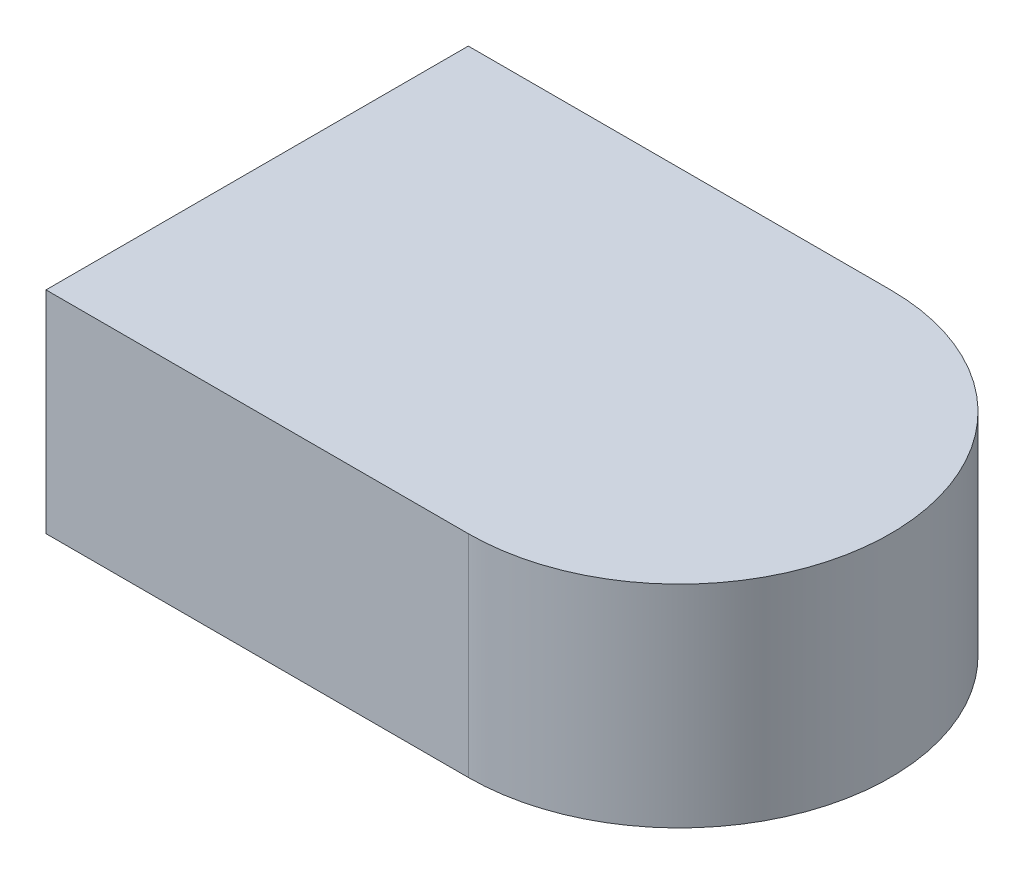
ISO-10303-21;
HEADER;
FILE_DESCRIPTION(('STEP AP214'),'2;1');
FILE_NAME('part.step','',(''),(''),'','','');
FILE_SCHEMA(('AUTOMOTIVE_DESIGN { 1 0 10303 214 1 1 1 1 }'));
ENDSEC;
DATA;
#1=APPLICATION_CONTEXT('core data for automotive mechanical design processes');
#2=APPLICATION_PROTOCOL_DEFINITION('international standard','automotive_design',2000,#1);
#3=PRODUCT_CONTEXT('',#1,'mechanical');
#4=PRODUCT('Part','Part','',(#3));
#5=PRODUCT_RELATED_PRODUCT_CATEGORY('part','',(#4));
#6=PRODUCT_DEFINITION_FORMATION('','',#4);
#7=PRODUCT_DEFINITION_CONTEXT('part definition',#1,'design');
#8=PRODUCT_DEFINITION('design','',#6,#7);
#9=PRODUCT_DEFINITION_SHAPE('','',#8);
#10=(LENGTH_UNIT() NAMED_UNIT(*) SI_UNIT(.MILLI.,.METRE.));
#11=(NAMED_UNIT(*) PLANE_ANGLE_UNIT() SI_UNIT($,.RADIAN.));
#12=(NAMED_UNIT(*) SI_UNIT($,.STERADIAN.) SOLID_ANGLE_UNIT());
#13=UNCERTAINTY_MEASURE_WITH_UNIT(LENGTH_MEASURE(1.E-05),#10,'distance_accuracy_value','');
#14=(GEOMETRIC_REPRESENTATION_CONTEXT(3) GLOBAL_UNCERTAINTY_ASSIGNED_CONTEXT((#13)) GLOBAL_UNIT_ASSIGNED_CONTEXT((#10,
#11,#12)) REPRESENTATION_CONTEXT('',''));
#15=CARTESIAN_POINT('',(0.,0.,0.));
#16=DIRECTION('',(0.,0.,1.));
#17=DIRECTION('',(1.,0.,0.));
#18=AXIS2_PLACEMENT_3D('',#15,#16,#17);
#19=CARTESIAN_POINT('',(0.,0.,0.));
#20=DIRECTION('',(0.,-1.,0.));
#21=DIRECTION('',(-1.,0.,0.));
#22=AXIS2_PLACEMENT_3D('',#19,#20,#21);
#23=PLANE('',#22);
#24=CARTESIAN_POINT('',(-1.05,0.,1.));
#25=DIRECTION('',(0.,-1.,0.));
#26=DIRECTION('',(0.,0.,-1.));
#27=AXIS2_PLACEMENT_3D('',#24,#25,#26);
#28=CIRCLE('',#27,0.1);
#29=CARTESIAN_POINT('',(-1.05,0.,0.9));
#30=VERTEX_POINT('',#29);
#31=CARTESIAN_POINT('',(-1.05,0.,1.1));
#32=VERTEX_POINT('',#31);
#33=EDGE_CURVE('E11',#30,#32,#28,.T.);
#34=ORIENTED_EDGE('',*,*,#33,.T.);
#35=DIRECTION('',(-1.,0.,0.));
#36=VECTOR('',#35,1.);
#37=CARTESIAN_POINT('',(-1.05,0.,1.1));
#38=LINE('',#37,#36);
#39=CARTESIAN_POINT('',(-1.25,0.,1.1));
#40=VERTEX_POINT('',#39);
#41=EDGE_CURVE('E25',#32,#40,#38,.T.);
#42=ORIENTED_EDGE('',*,*,#41,.T.);
#43=DIRECTION('',(0.,0.,-1.));
#44=VECTOR('',#43,1.);
#45=CARTESIAN_POINT('',(-1.25,0.,1.1));
#46=LINE('',#45,#44);
#47=CARTESIAN_POINT('',(-1.25,0.,0.9));
#48=VERTEX_POINT('',#47);
#49=EDGE_CURVE('E73',#40,#48,#46,.T.);
#50=ORIENTED_EDGE('',*,*,#49,.T.);
#51=DIRECTION('',(1.,0.,0.));
#52=VECTOR('',#51,1.);
#53=CARTESIAN_POINT('',(-1.25,0.,0.9));
#54=LINE('',#53,#52);
#55=EDGE_CURVE('E99',#48,#30,#54,.T.);
#56=ORIENTED_EDGE('',*,*,#55,.T.);
#57=EDGE_LOOP('',(#34,#42,#50,#56));
#58=FACE_BOUND('',#57,.T.);
#59=ADVANCED_FACE('F17',(#58),#23,.T.);
#60=CARTESIAN_POINT('',(-1.25,0.,0.9));
#61=DIRECTION('',(0.,0.,1.));
#62=DIRECTION('',(1.,0.,0.));
#63=AXIS2_PLACEMENT_3D('',#60,#61,#62);
#64=PLANE('',#63);
#65=DIRECTION('',(0.,1.,0.));
#66=VECTOR('',#65,1.);
#67=CARTESIAN_POINT('',(-1.25,0.,0.9));
#68=LINE('',#67,#66);
#69=CARTESIAN_POINT('',(-1.25,0.1,0.9));
#70=VERTEX_POINT('',#69);
#71=EDGE_CURVE('E95',#48,#70,#68,.T.);
#72=ORIENTED_EDGE('',*,*,#71,.T.);
#73=DIRECTION('',(1.,0.,0.));
#74=VECTOR('',#73,1.);
#75=CARTESIAN_POINT('',(-1.25,0.1,0.9));
#76=LINE('',#75,#74);
#77=CARTESIAN_POINT('',(-1.05,0.1,0.9));
#78=VERTEX_POINT('',#77);
#79=EDGE_CURVE('E68',#70,#78,#76,.T.);
#80=ORIENTED_EDGE('',*,*,#79,.T.);
#81=DIRECTION('',(0.,1.,0.));
#82=VECTOR('',#81,1.);
#83=CARTESIAN_POINT('',(-1.05,0.,0.9));
#84=LINE('',#83,#82);
#85=EDGE_CURVE('E87',#30,#78,#84,.T.);
#86=ORIENTED_EDGE('',*,*,#85,.F.);
#87=ORIENTED_EDGE('',*,*,#55,.F.);
#88=EDGE_LOOP('',(#72,#80,#86,#87));
#89=FACE_BOUND('',#88,.T.);
#90=ADVANCED_FACE('F113',(#89),#64,.F.);
#91=CARTESIAN_POINT('',(-1.05,0.,1.));
#92=DIRECTION('',(0.,-1.,0.));
#93=DIRECTION('',(-1.,0.,0.));
#94=AXIS2_PLACEMENT_3D('',#91,#92,#93);
#95=CYLINDRICAL_SURFACE('',#94,0.1);
#96=ORIENTED_EDGE('',*,*,#85,.T.);
#97=CARTESIAN_POINT('',(-1.05,0.1,1.));
#98=DIRECTION('',(0.,-1.,0.));
#99=DIRECTION('',(0.,0.,-1.));
#100=AXIS2_PLACEMENT_3D('',#97,#98,#99);
#101=CIRCLE('',#100,0.1);
#102=CARTESIAN_POINT('',(-1.05,0.1,1.1));
#103=VERTEX_POINT('',#102);
#104=EDGE_CURVE('E83',#78,#103,#101,.T.);
#105=ORIENTED_EDGE('',*,*,#104,.T.);
#106=DIRECTION('',(0.,1.,0.));
#107=VECTOR('',#106,1.);
#108=CARTESIAN_POINT('',(-1.05,0.,1.1));
#109=LINE('',#108,#107);
#110=EDGE_CURVE('E60',#32,#103,#109,.T.);
#111=ORIENTED_EDGE('',*,*,#110,.F.);
#112=ORIENTED_EDGE('',*,*,#33,.F.);
#113=EDGE_LOOP('',(#96,#105,#111,#112));
#114=FACE_BOUND('',#113,.T.);
#115=ADVANCED_FACE('F115',(#114),#95,.T.);
#116=CARTESIAN_POINT('',(-1.05,0.,1.1));
#117=DIRECTION('',(0.,0.,-1.));
#118=DIRECTION('',(-1.,0.,0.));
#119=AXIS2_PLACEMENT_3D('',#116,#117,#118);
#120=PLANE('',#119);
#121=ORIENTED_EDGE('',*,*,#110,.T.);
#122=DIRECTION('',(-1.,0.,0.));
#123=VECTOR('',#122,1.);
#124=CARTESIAN_POINT('',(-1.05,0.1,1.1));
#125=LINE('',#124,#123);
#126=CARTESIAN_POINT('',(-1.25,0.1,1.1));
#127=VERTEX_POINT('',#126);
#128=EDGE_CURVE('E53',#103,#127,#125,.T.);
#129=ORIENTED_EDGE('',*,*,#128,.T.);
#130=DIRECTION('',(0.,1.,0.));
#131=VECTOR('',#130,1.);
#132=CARTESIAN_POINT('',(-1.25,0.,1.1));
#133=LINE('',#132,#131);
#134=EDGE_CURVE('E57',#40,#127,#133,.T.);
#135=ORIENTED_EDGE('',*,*,#134,.F.);
#136=ORIENTED_EDGE('',*,*,#41,.F.);
#137=EDGE_LOOP('',(#121,#129,#135,#136));
#138=FACE_BOUND('',#137,.T.);
#139=ADVANCED_FACE('F55',(#138),#120,.F.);
#140=CARTESIAN_POINT('',(-1.25,0.,1.1));
#141=DIRECTION('',(1.,0.,0.));
#142=DIRECTION('',(0.,0.,-1.));
#143=AXIS2_PLACEMENT_3D('',#140,#141,#142);
#144=PLANE('',#143);
#145=ORIENTED_EDGE('',*,*,#134,.T.);
#146=DIRECTION('',(0.,0.,-1.));
#147=VECTOR('',#146,1.);
#148=CARTESIAN_POINT('',(-1.25,0.1,1.1));
#149=LINE('',#148,#147);
#150=EDGE_CURVE('E66',#127,#70,#149,.T.);
#151=ORIENTED_EDGE('',*,*,#150,.T.);
#152=ORIENTED_EDGE('',*,*,#71,.F.);
#153=ORIENTED_EDGE('',*,*,#49,.F.);
#154=EDGE_LOOP('',(#145,#151,#152,#153));
#155=FACE_BOUND('',#154,.T.);
#156=ADVANCED_FACE('F72',(#155),#144,.F.);
#157=CARTESIAN_POINT('',(0.,0.1,0.));
#158=DIRECTION('',(0.,-1.,0.));
#159=DIRECTION('',(-1.,0.,0.));
#160=AXIS2_PLACEMENT_3D('',#157,#158,#159);
#161=PLANE('',#160);
#162=ORIENTED_EDGE('',*,*,#150,.F.);
#163=ORIENTED_EDGE('',*,*,#128,.F.);
#164=ORIENTED_EDGE('',*,*,#104,.F.);
#165=ORIENTED_EDGE('',*,*,#79,.F.);
#166=EDGE_LOOP('',(#162,#163,#164,#165));
#167=FACE_BOUND('',#166,.T.);
#168=ADVANCED_FACE('F67',(#167),#161,.F.);
#169=CLOSED_SHELL('',(#59,#90,#115,#139,#156,#168));
#170=MANIFOLD_SOLID_BREP('B1',#169);
#171=ADVANCED_BREP_SHAPE_REPRESENTATION('',(#18,#170),#14);
#172=SHAPE_DEFINITION_REPRESENTATION(#9,#171);
ENDSEC;
END-ISO-10303-21;
